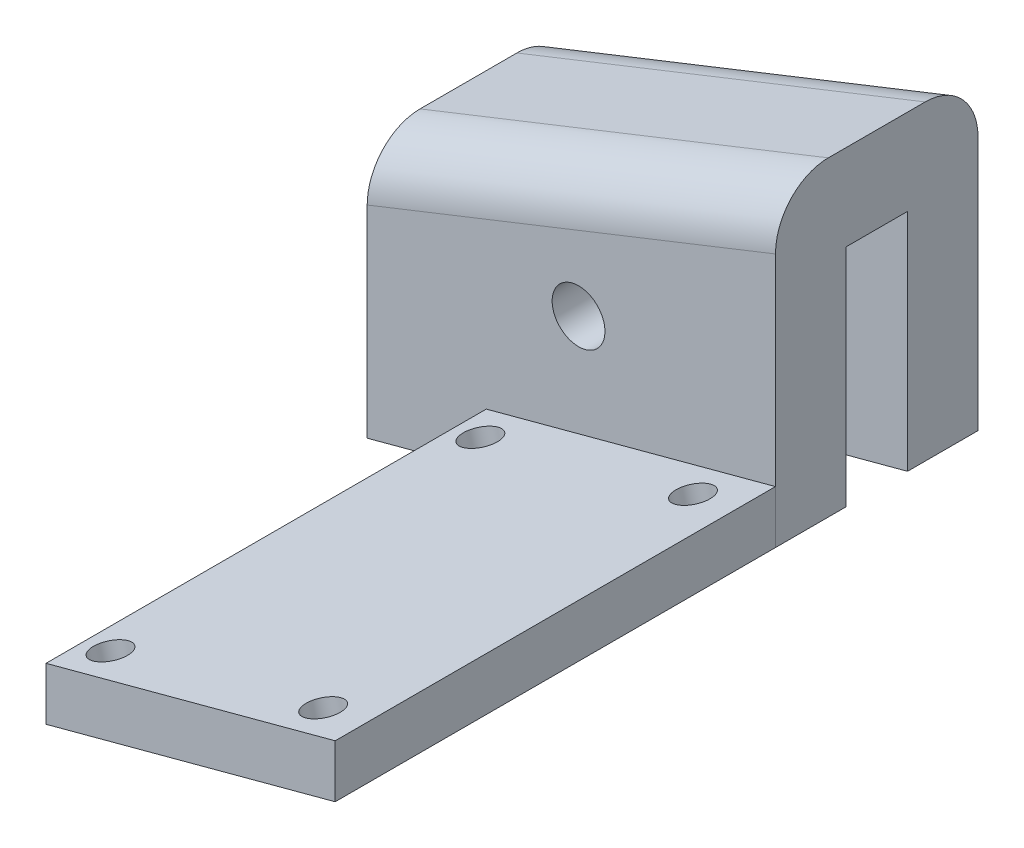
ISO-10303-21;
HEADER;
FILE_DESCRIPTION(('STEP AP214'),'2;1');
FILE_NAME('part.step','',(''),(''),'','','');
FILE_SCHEMA(('AUTOMOTIVE_DESIGN { 1 0 10303 214 1 1 1 1 }'));
ENDSEC;
DATA;
#1=APPLICATION_CONTEXT('core data for automotive mechanical design processes');
#2=APPLICATION_PROTOCOL_DEFINITION('international standard','automotive_design',2000,#1);
#3=PRODUCT_CONTEXT('',#1,'mechanical');
#4=PRODUCT('Part','Part','',(#3));
#5=PRODUCT_RELATED_PRODUCT_CATEGORY('part','',(#4));
#6=PRODUCT_DEFINITION_FORMATION('','',#4);
#7=PRODUCT_DEFINITION_CONTEXT('part definition',#1,'design');
#8=PRODUCT_DEFINITION('design','',#6,#7);
#9=PRODUCT_DEFINITION_SHAPE('','',#8);
#10=(LENGTH_UNIT() NAMED_UNIT(*) SI_UNIT(.MILLI.,.METRE.));
#11=(NAMED_UNIT(*) PLANE_ANGLE_UNIT() SI_UNIT($,.RADIAN.));
#12=(NAMED_UNIT(*) SI_UNIT($,.STERADIAN.) SOLID_ANGLE_UNIT());
#13=UNCERTAINTY_MEASURE_WITH_UNIT(LENGTH_MEASURE(1.E-05),#10,'distance_accuracy_value','');
#14=(GEOMETRIC_REPRESENTATION_CONTEXT(3) GLOBAL_UNCERTAINTY_ASSIGNED_CONTEXT((#13)) GLOBAL_UNIT_ASSIGNED_CONTEXT((#10,
#11,#12)) REPRESENTATION_CONTEXT('',''));
#15=CARTESIAN_POINT('',(0.,0.,0.));
#16=DIRECTION('',(0.,0.,1.));
#17=DIRECTION('',(1.,0.,0.));
#18=AXIS2_PLACEMENT_3D('',#15,#16,#17);
#19=CARTESIAN_POINT('',(0.,0.,4.));
#20=DIRECTION('',(0.,0.,1.));
#21=DIRECTION('',(1.,0.,0.));
#22=AXIS2_PLACEMENT_3D('',#19,#20,#21);
#23=PLANE('',#22);
#24=DIRECTION('',(0.965925826289065,0.258819045102531,0.));
#25=VECTOR('',#24,1.);
#26=CARTESIAN_POINT('',(180.956435006935,-56.1704509067187,4.));
#27=LINE('',#26,#25);
#28=CARTESIAN_POINT('',(180.956435006935,-56.1704509067187,4.));
#29=VERTEX_POINT('',#28);
#30=CARTESIAN_POINT('',(197.377174053849,-51.7705271399756,4.));
#31=VERTEX_POINT('',#30);
#32=EDGE_CURVE('E102',#29,#31,#27,.T.);
#33=ORIENTED_EDGE('',*,*,#32,.F.);
#34=DIRECTION('',(0.,-1.,0.));
#35=VECTOR('',#34,1.);
#36=CARTESIAN_POINT('',(180.956435006935,-53.1704509067186,4.));
#37=LINE('',#36,#35);
#38=CARTESIAN_POINT('',(180.956435006935,-53.1704509067186,4.));
#39=VERTEX_POINT('',#38);
#40=EDGE_CURVE('E117',#39,#29,#37,.T.);
#41=ORIENTED_EDGE('',*,*,#40,.F.);
#42=DIRECTION('',(-0.965925826289066,-0.258819045102531,0.));
#43=VECTOR('',#42,1.);
#44=CARTESIAN_POINT('',(197.377174053849,-48.7705271399756,4.));
#45=LINE('',#44,#43);
#46=CARTESIAN_POINT('',(197.377174053849,-48.7705271399756,4.));
#47=VERTEX_POINT('',#46);
#48=EDGE_CURVE('E104',#47,#39,#45,.T.);
#49=ORIENTED_EDGE('',*,*,#48,.F.);
#50=DIRECTION('',(0.,1.,0.));
#51=VECTOR('',#50,1.);
#52=CARTESIAN_POINT('',(197.377174053849,-51.7705271399756,4.));
#53=LINE('',#52,#51);
#54=EDGE_CURVE('E94',#31,#47,#53,.T.);
#55=ORIENTED_EDGE('',*,*,#54,.F.);
#56=EDGE_LOOP('',(#33,#41,#49,#55));
#57=FACE_BOUND('',#56,.T.);
#58=ADVANCED_FACE('F52',(#57),#23,.F.);
#59=CARTESIAN_POINT('',(180.956435006935,-53.1704509067186,47.0110949861595));
#60=DIRECTION('',(1.,0.,0.));
#61=DIRECTION('',(0.,0.,-1.));
#62=AXIS2_PLACEMENT_3D('',#59,#60,#61);
#63=PLANE('',#62);
#64=DIRECTION('',(0.,0.,-1.));
#65=VECTOR('',#64,1.);
#66=CARTESIAN_POINT('',(180.956435006935,-56.1704509067187,47.0110949861595));
#67=LINE('',#66,#65);
#68=CARTESIAN_POINT('',(180.956435006935,-56.1704509067187,29.));
#69=VERTEX_POINT('',#68);
#70=EDGE_CURVE('E107',#69,#29,#67,.T.);
#71=ORIENTED_EDGE('',*,*,#70,.F.);
#72=DIRECTION('',(0.,1.,0.));
#73=VECTOR('',#72,1.);
#74=CARTESIAN_POINT('',(180.956435006935,-53.1704509067186,29.));
#75=LINE('',#74,#73);
#76=CARTESIAN_POINT('',(180.956435006935,-53.1704509067186,29.));
#77=VERTEX_POINT('',#76);
#78=EDGE_CURVE('E56',#69,#77,#75,.T.);
#79=ORIENTED_EDGE('',*,*,#78,.T.);
#80=DIRECTION('',(0.,0.,-1.));
#81=VECTOR('',#80,1.);
#82=CARTESIAN_POINT('',(180.956435006935,-53.1704509067186,47.0110949861595));
#83=LINE('',#82,#81);
#84=EDGE_CURVE('E120',#77,#39,#83,.T.);
#85=ORIENTED_EDGE('',*,*,#84,.T.);
#86=ORIENTED_EDGE('',*,*,#40,.T.);
#87=EDGE_LOOP('',(#71,#79,#85,#86));
#88=FACE_BOUND('',#87,.T.);
#89=ADVANCED_FACE('F166',(#88),#63,.F.);
#90=CARTESIAN_POINT('',(197.377174053849,-48.7705271399756,47.0110949861595));
#91=DIRECTION('',(0.258819045102531,-0.965925826289066,0.));
#92=DIRECTION('',(0.965925826289066,0.258819045102531,0.));
#93=AXIS2_PLACEMENT_3D('',#90,#91,#92);
#94=PLANE('',#93);
#95=CARTESIAN_POINT('',(182.621249572658,-52.7243651882857,27.));
#96=DIRECTION('',(0.258819045102531,-0.965925826289066,0.));
#97=DIRECTION('',(0.965925826289066,0.258819045102531,0.));
#98=AXIS2_PLACEMENT_3D('',#95,#96,#97);
#99=CIRCLE('',#98,0.999999999999999);
#100=CARTESIAN_POINT('',(183.587175398947,-52.4655461431831,27.));
#101=VERTEX_POINT('',#100);
#102=EDGE_CURVE('E109',#101,#101,#99,.T.);
#103=ORIENTED_EDGE('',*,*,#102,.T.);
#104=EDGE_LOOP('',(#103));
#105=FACE_BOUND('',#104,.T.);
#106=CARTESIAN_POINT('',(194.695322401271,-49.489127124504,6.));
#107=DIRECTION('',(0.258819045102531,-0.965925826289066,0.));
#108=DIRECTION('',(0.965925826289066,0.258819045102531,0.));
#109=AXIS2_PLACEMENT_3D('',#106,#107,#108);
#110=CIRCLE('',#109,0.999999999999999);
#111=CARTESIAN_POINT('',(195.66124822756,-49.2303080794015,6.));
#112=VERTEX_POINT('',#111);
#113=EDGE_CURVE('E112',#112,#112,#110,.T.);
#114=ORIENTED_EDGE('',*,*,#113,.T.);
#115=EDGE_LOOP('',(#114));
#116=FACE_BOUND('',#115,.T.);
#117=CARTESIAN_POINT('',(194.695322401271,-49.489127124504,27.));
#118=DIRECTION('',(0.258819045102531,-0.965925826289066,0.));
#119=DIRECTION('',(0.965925826289066,0.258819045102531,0.));
#120=AXIS2_PLACEMENT_3D('',#117,#118,#119);
#121=CIRCLE('',#120,0.999999999999999);
#122=CARTESIAN_POINT('',(195.66124822756,-49.2303080794015,27.));
#123=VERTEX_POINT('',#122);
#124=EDGE_CURVE('E131',#123,#123,#121,.T.);
#125=ORIENTED_EDGE('',*,*,#124,.T.);
#126=EDGE_LOOP('',(#125));
#127=FACE_BOUND('',#126,.T.);
#128=CARTESIAN_POINT('',(182.621249572658,-52.7243651882857,6.));
#129=DIRECTION('',(0.258819045102531,-0.965925826289066,0.));
#130=DIRECTION('',(0.965925826289066,0.258819045102531,0.));
#131=AXIS2_PLACEMENT_3D('',#128,#129,#130);
#132=CIRCLE('',#131,0.999999999999999);
#133=CARTESIAN_POINT('',(183.587175398947,-52.4655461431832,6.));
#134=VERTEX_POINT('',#133);
#135=EDGE_CURVE('E134',#134,#134,#132,.T.);
#136=ORIENTED_EDGE('',*,*,#135,.T.);
#137=EDGE_LOOP('',(#136));
#138=FACE_BOUND('',#137,.T.);
#139=ORIENTED_EDGE('',*,*,#84,.F.);
#140=DIRECTION('',(0.965925826289066,0.258819045102531,0.));
#141=VECTOR('',#140,1.);
#142=CARTESIAN_POINT('',(197.377174053849,-48.7705271399756,29.));
#143=LINE('',#142,#141);
#144=CARTESIAN_POINT('',(197.377174053849,-48.7705271399756,29.));
#145=VERTEX_POINT('',#144);
#146=EDGE_CURVE('E126',#77,#145,#143,.T.);
#147=ORIENTED_EDGE('',*,*,#146,.T.);
#148=DIRECTION('',(0.,0.,-1.));
#149=VECTOR('',#148,1.);
#150=CARTESIAN_POINT('',(197.377174053849,-48.7705271399756,47.0110949861595));
#151=LINE('',#150,#149);
#152=EDGE_CURVE('E98',#145,#47,#151,.T.);
#153=ORIENTED_EDGE('',*,*,#152,.T.);
#154=ORIENTED_EDGE('',*,*,#48,.T.);
#155=EDGE_LOOP('',(#139,#147,#153,#154));
#156=FACE_BOUND('',#155,.T.);
#157=ADVANCED_FACE('F125',(#105,#116,#127,#138,#156),#94,.F.);
#158=CARTESIAN_POINT('',(197.377174053849,-51.7705271399756,47.0110949861595));
#159=DIRECTION('',(-1.,0.,0.));
#160=DIRECTION('',(0.,0.,1.));
#161=AXIS2_PLACEMENT_3D('',#158,#159,#160);
#162=PLANE('',#161);
#163=ORIENTED_EDGE('',*,*,#152,.F.);
#164=DIRECTION('',(0.,-1.,0.));
#165=VECTOR('',#164,1.);
#166=CARTESIAN_POINT('',(197.377174053849,-51.7705271399756,29.));
#167=LINE('',#166,#165);
#168=CARTESIAN_POINT('',(197.377174053849,-51.7705271399756,29.));
#169=VERTEX_POINT('',#168);
#170=EDGE_CURVE('E61',#145,#169,#167,.T.);
#171=ORIENTED_EDGE('',*,*,#170,.T.);
#172=DIRECTION('',(0.,0.,-1.));
#173=VECTOR('',#172,1.);
#174=CARTESIAN_POINT('',(197.377174053849,-51.7705271399756,47.0110949861595));
#175=LINE('',#174,#173);
#176=EDGE_CURVE('E91',#169,#31,#175,.T.);
#177=ORIENTED_EDGE('',*,*,#176,.T.);
#178=ORIENTED_EDGE('',*,*,#54,.T.);
#179=EDGE_LOOP('',(#163,#171,#177,#178));
#180=FACE_BOUND('',#179,.T.);
#181=ADVANCED_FACE('F93',(#180),#162,.F.);
#182=CARTESIAN_POINT('',(180.956435006935,-56.1704509067187,47.0110949861595));
#183=DIRECTION('',(-0.258819045102531,0.965925826289065,0.));
#184=DIRECTION('',(-0.965925826289066,-0.258819045102531,0.));
#185=AXIS2_PLACEMENT_3D('',#182,#183,#184);
#186=PLANE('',#185);
#187=CARTESIAN_POINT('',(183.371249572658,-55.5234032939624,27.));
#188=DIRECTION('',(0.258819045102531,-0.965925826289065,0.));
#189=DIRECTION('',(0.965925826289066,0.258819045102531,0.));
#190=AXIS2_PLACEMENT_3D('',#187,#188,#189);
#191=CIRCLE('',#190,0.999999999999999);
#192=CARTESIAN_POINT('',(184.337175398947,-55.2645842488598,27.));
#193=VERTEX_POINT('',#192);
#194=EDGE_CURVE('E140',#193,#193,#191,.T.);
#195=ORIENTED_EDGE('',*,*,#194,.F.);
#196=EDGE_LOOP('',(#195));
#197=FACE_BOUND('',#196,.T.);
#198=CARTESIAN_POINT('',(195.445322401271,-52.2881652301807,6.));
#199=DIRECTION('',(0.258819045102531,-0.965925826289065,0.));
#200=DIRECTION('',(0.965925826289066,0.258819045102531,0.));
#201=AXIS2_PLACEMENT_3D('',#198,#199,#200);
#202=CIRCLE('',#201,0.999999999999999);
#203=CARTESIAN_POINT('',(196.41124822756,-52.0293461850782,6.));
#204=VERTEX_POINT('',#203);
#205=EDGE_CURVE('E141',#204,#204,#202,.T.);
#206=ORIENTED_EDGE('',*,*,#205,.F.);
#207=EDGE_LOOP('',(#206));
#208=FACE_BOUND('',#207,.T.);
#209=CARTESIAN_POINT('',(195.445322401271,-52.2881652301807,27.));
#210=DIRECTION('',(0.258819045102531,-0.965925826289065,0.));
#211=DIRECTION('',(0.965925826289066,0.258819045102531,0.));
#212=AXIS2_PLACEMENT_3D('',#209,#210,#211);
#213=CIRCLE('',#212,0.999999999999999);
#214=CARTESIAN_POINT('',(196.41124822756,-52.0293461850782,27.));
#215=VERTEX_POINT('',#214);
#216=EDGE_CURVE('E144',#215,#215,#213,.T.);
#217=ORIENTED_EDGE('',*,*,#216,.F.);
#218=EDGE_LOOP('',(#217));
#219=FACE_BOUND('',#218,.T.);
#220=CARTESIAN_POINT('',(183.371249572658,-55.5234032939624,6.));
#221=DIRECTION('',(0.258819045102531,-0.965925826289065,0.));
#222=DIRECTION('',(0.965925826289066,0.258819045102531,0.));
#223=AXIS2_PLACEMENT_3D('',#220,#221,#222);
#224=CIRCLE('',#223,0.999999999999999);
#225=CARTESIAN_POINT('',(184.337175398947,-55.2645842488598,6.));
#226=VERTEX_POINT('',#225);
#227=EDGE_CURVE('E137',#226,#226,#224,.T.);
#228=ORIENTED_EDGE('',*,*,#227,.F.);
#229=EDGE_LOOP('',(#228));
#230=FACE_BOUND('',#229,.T.);
#231=ORIENTED_EDGE('',*,*,#176,.F.);
#232=DIRECTION('',(-0.965925826289066,-0.258819045102531,0.));
#233=VECTOR('',#232,1.);
#234=CARTESIAN_POINT('',(180.956435006935,-56.1704509067187,29.));
#235=LINE('',#234,#233);
#236=EDGE_CURVE('E12',#169,#69,#235,.T.);
#237=ORIENTED_EDGE('',*,*,#236,.T.);
#238=ORIENTED_EDGE('',*,*,#70,.T.);
#239=ORIENTED_EDGE('',*,*,#32,.T.);
#240=EDGE_LOOP('',(#231,#237,#238,#239));
#241=FACE_BOUND('',#240,.T.);
#242=ADVANCED_FACE('F54',(#197,#208,#219,#230,#241),#186,.F.);
#243=CARTESIAN_POINT('',(174.453773268014,-58.9481100487254,29.));
#244=DIRECTION('',(0.,0.,-1.));
#245=DIRECTION('',(0.965925826289065,0.258819045102531,0.));
#246=AXIS2_PLACEMENT_3D('',#243,#244,#245);
#247=PLANE('',#246);
#248=ORIENTED_EDGE('',*,*,#170,.F.);
#249=ORIENTED_EDGE('',*,*,#146,.F.);
#250=ORIENTED_EDGE('',*,*,#78,.F.);
#251=ORIENTED_EDGE('',*,*,#236,.F.);
#252=EDGE_LOOP('',(#248,#249,#250,#251));
#253=FACE_BOUND('',#252,.T.);
#254=ADVANCED_FACE('F155',(#253),#247,.F.);
#255=CARTESIAN_POINT('',(174.571402039172,-22.6819252001342,6.));
#256=DIRECTION('',(0.258819045102531,-0.965925826289066,0.));
#257=DIRECTION('',(0.965925826289066,0.258819045102531,0.));
#258=AXIS2_PLACEMENT_3D('',#255,#256,#257);
#259=CYLINDRICAL_SURFACE('',#258,0.999999999999999);
#260=ORIENTED_EDGE('',*,*,#227,.T.);
#261=EDGE_LOOP('',(#260));
#262=FACE_BOUND('',#261,.T.);
#263=ORIENTED_EDGE('',*,*,#135,.F.);
#264=EDGE_LOOP('',(#263));
#265=FACE_BOUND('',#264,.T.);
#266=ADVANCED_FACE('F159',(#262,#265),#259,.F.);
#267=CARTESIAN_POINT('',(186.645474867785,-19.4466871363525,27.));
#268=DIRECTION('',(0.258819045102531,-0.965925826289066,0.));
#269=DIRECTION('',(0.965925826289066,0.258819045102531,0.));
#270=AXIS2_PLACEMENT_3D('',#267,#268,#269);
#271=CYLINDRICAL_SURFACE('',#270,0.999999999999999);
#272=ORIENTED_EDGE('',*,*,#216,.T.);
#273=EDGE_LOOP('',(#272));
#274=FACE_BOUND('',#273,.T.);
#275=ORIENTED_EDGE('',*,*,#124,.F.);
#276=EDGE_LOOP('',(#275));
#277=FACE_BOUND('',#276,.T.);
#278=ADVANCED_FACE('F150',(#274,#277),#271,.F.);
#279=CARTESIAN_POINT('',(186.645474867785,-19.4466871363525,6.));
#280=DIRECTION('',(0.258819045102531,-0.965925826289066,0.));
#281=DIRECTION('',(0.965925826289066,0.258819045102531,0.));
#282=AXIS2_PLACEMENT_3D('',#279,#280,#281);
#283=CYLINDRICAL_SURFACE('',#282,0.999999999999999);
#284=ORIENTED_EDGE('',*,*,#205,.T.);
#285=EDGE_LOOP('',(#284));
#286=FACE_BOUND('',#285,.T.);
#287=ORIENTED_EDGE('',*,*,#113,.F.);
#288=EDGE_LOOP('',(#287));
#289=FACE_BOUND('',#288,.T.);
#290=ADVANCED_FACE('F183',(#286,#289),#283,.F.);
#291=CARTESIAN_POINT('',(174.571402039172,-22.6819252001341,27.));
#292=DIRECTION('',(0.258819045102531,-0.965925826289066,0.));
#293=DIRECTION('',(0.965925826289066,0.258819045102531,0.));
#294=AXIS2_PLACEMENT_3D('',#291,#292,#293);
#295=CYLINDRICAL_SURFACE('',#294,0.999999999999999);
#296=ORIENTED_EDGE('',*,*,#194,.T.);
#297=EDGE_LOOP('',(#296));
#298=FACE_BOUND('',#297,.T.);
#299=ORIENTED_EDGE('',*,*,#102,.F.);
#300=EDGE_LOOP('',(#299));
#301=FACE_BOUND('',#300,.T.);
#302=ADVANCED_FACE('F186',(#298,#301),#295,.F.);
#303=CLOSED_SHELL('',(#58,#89,#157,#181,#242,#254,#266,#278,#290,#302));
#304=MANIFOLD_SOLID_BREP('B2',#303);
#305=CARTESIAN_POINT('',(0.,0.,0.));
#306=DIRECTION('',(0.,0.,-1.));
#307=DIRECTION('',(-1.,0.,0.));
#308=AXIS2_PLACEMENT_3D('',#305,#306,#307);
#309=PLANE('',#308);
#310=CARTESIAN_POINT('',(186.194954222912,-45.9821842224364,0.));
#311=DIRECTION('',(0.,0.,-1.));
#312=DIRECTION('',(-1.,0.,0.));
#313=AXIS2_PLACEMENT_3D('',#310,#311,#312);
#314=CIRCLE('',#313,1.5);
#315=CARTESIAN_POINT('',(184.694954222912,-45.9821842224364,0.));
#316=VERTEX_POINT('',#315);
#317=EDGE_CURVE('E484',#316,#316,#314,.T.);
#318=ORIENTED_EDGE('',*,*,#317,.F.);
#319=EDGE_LOOP('',(#318));
#320=FACE_BOUND('',#319,.T.);
#321=DIRECTION('',(0.,-1.,0.));
#322=VECTOR('',#321,1.);
#323=CARTESIAN_POINT('',(174.194954222912,-57.9821842224364,0.));
#324=LINE('',#323,#322);
#325=CARTESIAN_POINT('',(174.194954222913,-48.3475542224693,0.));
#326=VERTEX_POINT('',#325);
#327=CARTESIAN_POINT('',(174.194954222912,-57.9821842224364,0.));
#328=VERTEX_POINT('',#327);
#329=EDGE_CURVE('E459',#326,#328,#324,.T.);
#330=ORIENTED_EDGE('',*,*,#329,.F.);
#331=CARTESIAN_POINT('',(154.999999916871,-54.0482308469535,0.));
#332=CARTESIAN_POINT('',(155.731406057589,-53.8620106613131,0.));
#333=CARTESIAN_POINT('',(158.353021704778,-53.1825677741812,0.));
#334=CARTESIAN_POINT('',(164.660096697761,-51.4419935318653,0.));
#335=CARTESIAN_POINT('',(173.748419645787,-48.5940055598413,0.));
#336=CARTESIAN_POINT('',(184.26927531825,-44.7413254498893,0.));
#337=CARTESIAN_POINT('',(197.799833821469,-39.0240238482658,0.));
#338=CARTESIAN_POINT('',(213.78961101986,-30.7928618903945,0.));
#339=CARTESIAN_POINT('',(231.549414252278,-19.1756565135875,0.));
#340=CARTESIAN_POINT('',(247.929177810818,-5.79714362559889,0.));
#341=CARTESIAN_POINT('',(260.462024810725,6.84921209286295,0.));
#342=CARTESIAN_POINT('',(269.83072194683,17.8876076715245,0.));
#343=CARTESIAN_POINT('',(276.528937944344,26.6313311327526,0.));
#344=CARTESIAN_POINT('',(281.840598342277,34.3146395086273,0.));
#345=CARTESIAN_POINT('',(285.585821403611,40.1670188130852,0.));
#346=CARTESIAN_POINT('',(287.25914441583,42.8980000515154,0.));
#347=CARTESIAN_POINT('',(287.922750115386,44.0000001015957,0.));
#348=B_SPLINE_CURVE_WITH_KNOTS('',3,(#331,#332,#333,#334,#335,#336,#337,#338,#339,#340,#341,
#342,#343,#344,#345,#346,#347),.UNSPECIFIED.,.F.,.F.,(4,1,1,1,1,1,1,1,1,1,1,1,1,1,4),
(0.497752743346389,0.497805621376866,0.497942734042408,0.49821695937349,0.498491184704572,
0.498765410035654,0.499313860697819,0.499862311359984,0.500410762022148,0.500959212684313,
0.501233438015395,0.501507663346477,0.50178188867756,0.501919001343101,0.502011046799067),.UNSPECIFIED.);
#349=CARTESIAN_POINT('',(197.377174053848,-38.9869215014192,0.));
#350=VERTEX_POINT('',#349);
#351=EDGE_CURVE('E369',#326,#350,#348,.T.);
#352=ORIENTED_EDGE('',*,*,#351,.T.);
#353=DIRECTION('',(0.,1.,0.));
#354=VECTOR('',#353,1.);
#355=CARTESIAN_POINT('',(197.377174053848,-34.1054023962247,0.));
#356=LINE('',#355,#354);
#357=CARTESIAN_POINT('',(197.377174053849,-51.7705271399756,0.));
#358=VERTEX_POINT('',#357);
#359=EDGE_CURVE('E452',#358,#350,#356,.T.);
#360=ORIENTED_EDGE('',*,*,#359,.F.);
#361=DIRECTION('',(0.965925826289065,0.258819045102531,0.));
#362=VECTOR('',#361,1.);
#363=CARTESIAN_POINT('',(174.194954222912,-57.9821842224364,0.));
#364=LINE('',#363,#362);
#365=EDGE_CURVE('E456',#328,#358,#364,.T.);
#366=ORIENTED_EDGE('',*,*,#365,.F.);
#367=EDGE_LOOP('',(#330,#352,#360,#366));
#368=FACE_BOUND('',#367,.T.);
#369=ADVANCED_FACE('F265',(#320,#368),#309,.T.);
#370=CARTESIAN_POINT('',(174.194954222913,-43.2884389489036,4.));
#371=DIRECTION('',(0.368282170769965,-0.92971406501836,0.));
#372=DIRECTION('',(0.92971406501836,0.368282170769965,0.));
#373=AXIS2_PLACEMENT_3D('',#370,#371,#372);
#374=PLANE('',#373);
#375=DIRECTION('',(0.,0.,-1.));
#376=VECTOR('',#375,1.);
#377=CARTESIAN_POINT('',(197.377174053848,-34.1054023962247,4.));
#378=LINE('',#377,#376);
#379=CARTESIAN_POINT('',(197.377174053848,-34.1054023962247,1.));
#380=VERTEX_POINT('',#379);
#381=CARTESIAN_POINT('',(197.377174053848,-34.1054023962247,-4.5));
#382=VERTEX_POINT('',#381);
#383=EDGE_CURVE('E449',#380,#382,#378,.T.);
#384=ORIENTED_EDGE('',*,*,#383,.T.);
#385=DIRECTION('',(0.92971406501836,0.368282170769965,0.));
#386=VECTOR('',#385,1.);
#387=CARTESIAN_POINT('',(174.194954222913,-43.2884389489036,-4.5));
#388=LINE('',#387,#386);
#389=CARTESIAN_POINT('',(174.194954222913,-43.2884389489036,-4.5));
#390=VERTEX_POINT('',#389);
#391=EDGE_CURVE('E287',#382,#390,#388,.F.);
#392=ORIENTED_EDGE('',*,*,#391,.T.);
#393=DIRECTION('',(0.,0.,-1.));
#394=VECTOR('',#393,1.);
#395=CARTESIAN_POINT('',(174.194954222913,-43.2884389489036,4.));
#396=LINE('',#395,#394);
#397=CARTESIAN_POINT('',(174.194954222913,-43.2884389489036,1.));
#398=VERTEX_POINT('',#397);
#399=EDGE_CURVE('E436',#398,#390,#396,.T.);
#400=ORIENTED_EDGE('',*,*,#399,.F.);
#401=DIRECTION('',(-0.92971406501836,-0.368282170769965,0.));
#402=VECTOR('',#401,1.);
#403=CARTESIAN_POINT('',(174.194954222913,-43.2884389489036,1.));
#404=LINE('',#403,#402);
#405=EDGE_CURVE('E429',#398,#380,#404,.F.);
#406=ORIENTED_EDGE('',*,*,#405,.T.);
#407=EDGE_LOOP('',(#384,#392,#400,#406));
#408=FACE_BOUND('',#407,.T.);
#409=ADVANCED_FACE('F401',(#408),#374,.F.);
#410=CARTESIAN_POINT('',(174.194954222912,-57.9821842224364,4.));
#411=DIRECTION('',(1.,0.,0.));
#412=DIRECTION('',(0.,1.,0.));
#413=AXIS2_PLACEMENT_3D('',#410,#411,#412);
#414=PLANE('',#413);
#415=ORIENTED_EDGE('',*,*,#399,.T.);
#416=CARTESIAN_POINT('',(174.194954222913,-46.5152375022209,-4.5));
#417=DIRECTION('',(1.,0.,0.));
#418=DIRECTION('',(0.,-1.,0.));
#419=AXIS2_PLACEMENT_3D('',#416,#417,#418);
#420=ELLIPSE('',#419,3.2267985533174,3.);
#421=CARTESIAN_POINT('',(174.194954222912,-46.515237502221,-7.5));
#422=VERTEX_POINT('',#421);
#423=EDGE_CURVE('E273',#390,#422,#420,.F.);
#424=ORIENTED_EDGE('',*,*,#423,.T.);
#425=DIRECTION('',(0.,1.,0.));
#426=VECTOR('',#425,1.);
#427=CARTESIAN_POINT('',(174.194954222912,-57.9821842224364,-7.5));
#428=LINE('',#427,#426);
#429=CARTESIAN_POINT('',(174.194954222912,-57.9821842224364,-7.5));
#430=VERTEX_POINT('',#429);
#431=EDGE_CURVE('E363',#430,#422,#428,.T.);
#432=ORIENTED_EDGE('',*,*,#431,.F.);
#433=DIRECTION('',(0.,0.,1.));
#434=VECTOR('',#433,1.);
#435=CARTESIAN_POINT('',(174.194954222912,-57.9821842224364,-7.5));
#436=LINE('',#435,#434);
#437=CARTESIAN_POINT('',(174.194954222912,-57.9821842224364,-3.5));
#438=VERTEX_POINT('',#437);
#439=EDGE_CURVE('E361',#430,#438,#436,.T.);
#440=ORIENTED_EDGE('',*,*,#439,.T.);
#441=DIRECTION('',(0.,1.,0.));
#442=VECTOR('',#441,1.);
#443=CARTESIAN_POINT('',(174.194954222912,-57.9821842224364,-3.5));
#444=LINE('',#443,#442);
#445=CARTESIAN_POINT('',(174.194954222912,-48.3475542224685,-3.5));
#446=VERTEX_POINT('',#445);
#447=EDGE_CURVE('E354',#438,#446,#444,.T.);
#448=ORIENTED_EDGE('',*,*,#447,.T.);
#449=DIRECTION('',(0.,0.,1.));
#450=VECTOR('',#449,1.);
#451=CARTESIAN_POINT('',(174.194954222913,-48.3475542224693,-3.5));
#452=LINE('',#451,#450);
#453=EDGE_CURVE('E461',#446,#326,#452,.T.);
#454=ORIENTED_EDGE('',*,*,#453,.T.);
#455=ORIENTED_EDGE('',*,*,#329,.T.);
#456=DIRECTION('',(0.,0.,-1.));
#457=VECTOR('',#456,1.);
#458=CARTESIAN_POINT('',(174.194954222912,-57.9821842224364,4.));
#459=LINE('',#458,#457);
#460=CARTESIAN_POINT('',(174.194954222912,-57.9821842224364,4.));
#461=VERTEX_POINT('',#460);
#462=EDGE_CURVE('E443',#461,#328,#459,.T.);
#463=ORIENTED_EDGE('',*,*,#462,.F.);
#464=DIRECTION('',(0.,-1.,0.));
#465=VECTOR('',#464,1.);
#466=CARTESIAN_POINT('',(174.194954222913,-48.3475542224685,4.));
#467=LINE('',#466,#465);
#468=CARTESIAN_POINT('',(174.194954222913,-46.5152375022209,4.));
#469=VERTEX_POINT('',#468);
#470=EDGE_CURVE('E455',#469,#461,#467,.T.);
#471=ORIENTED_EDGE('',*,*,#470,.F.);
#472=CARTESIAN_POINT('',(174.194954222913,-46.5152375022209,1.));
#473=DIRECTION('',(1.,0.,0.));
#474=DIRECTION('',(0.,-1.,0.));
#475=AXIS2_PLACEMENT_3D('',#472,#473,#474);
#476=ELLIPSE('',#475,3.2267985533174,3.);
#477=EDGE_CURVE('E280',#469,#398,#476,.F.);
#478=ORIENTED_EDGE('',*,*,#477,.T.);
#479=EDGE_LOOP('',(#415,#424,#432,#440,#448,#454,#455,#463,#471,#478));
#480=FACE_BOUND('',#479,.T.);
#481=ADVANCED_FACE('F408',(#480),#414,.F.);
#482=CARTESIAN_POINT('',(174.194954222912,-57.9821842224364,4.));
#483=DIRECTION('',(-0.258819045102531,0.965925826289065,0.));
#484=DIRECTION('',(-0.965925826289066,-0.258819045102531,0.));
#485=AXIS2_PLACEMENT_3D('',#482,#483,#484);
#486=PLANE('',#485);
#487=ORIENTED_EDGE('',*,*,#365,.T.);
#488=DIRECTION('',(0.,0.,-1.));
#489=VECTOR('',#488,1.);
#490=CARTESIAN_POINT('',(197.377174053849,-51.7705271399756,4.));
#491=LINE('',#490,#489);
#492=CARTESIAN_POINT('',(197.377174053849,-51.7705271399756,4.));
#493=VERTEX_POINT('',#492);
#494=EDGE_CURVE('E446',#493,#358,#491,.T.);
#495=ORIENTED_EDGE('',*,*,#494,.F.);
#496=DIRECTION('',(0.965925826289065,0.258819045102531,0.));
#497=VECTOR('',#496,1.);
#498=CARTESIAN_POINT('',(174.194954222912,-57.9821842224364,4.));
#499=LINE('',#498,#497);
#500=EDGE_CURVE('E464',#461,#493,#499,.T.);
#501=ORIENTED_EDGE('',*,*,#500,.F.);
#502=ORIENTED_EDGE('',*,*,#462,.T.);
#503=EDGE_LOOP('',(#487,#495,#501,#502));
#504=FACE_BOUND('',#503,.T.);
#505=ADVANCED_FACE('F405',(#504),#486,.F.);
#506=CARTESIAN_POINT('',(197.377174053848,-34.1054023962247,4.));
#507=DIRECTION('',(-1.,0.,0.));
#508=DIRECTION('',(0.,0.,1.));
#509=AXIS2_PLACEMENT_3D('',#506,#507,#508);
#510=PLANE('',#509);
#511=DIRECTION('',(0.,-1.,0.));
#512=VECTOR('',#511,1.);
#513=CARTESIAN_POINT('',(197.377174053848,-34.1054023962247,-7.5));
#514=LINE('',#513,#512);
#515=CARTESIAN_POINT('',(197.377174053848,-37.3322009495418,-7.5));
#516=VERTEX_POINT('',#515);
#517=CARTESIAN_POINT('',(197.377174053849,-51.7705271399756,-7.5));
#518=VERTEX_POINT('',#517);
#519=EDGE_CURVE('E344',#516,#518,#514,.T.);
#520=ORIENTED_EDGE('',*,*,#519,.F.);
#521=CARTESIAN_POINT('',(197.377174053848,-37.332200949542,-4.5));
#522=DIRECTION('',(-1.,0.,0.));
#523=DIRECTION('',(0.,-1.,0.));
#524=AXIS2_PLACEMENT_3D('',#521,#522,#523);
#525=ELLIPSE('',#524,3.22679855331731,3.);
#526=EDGE_CURVE('E431',#516,#382,#525,.F.);
#527=ORIENTED_EDGE('',*,*,#526,.T.);
#528=ORIENTED_EDGE('',*,*,#383,.F.);
#529=CARTESIAN_POINT('',(197.377174053848,-37.332200949542,1.));
#530=DIRECTION('',(-1.,0.,0.));
#531=DIRECTION('',(0.,-1.,0.));
#532=AXIS2_PLACEMENT_3D('',#529,#530,#531);
#533=ELLIPSE('',#532,3.22679855331731,3.);
#534=CARTESIAN_POINT('',(197.377174053847,-37.3322009495421,4.));
#535=VERTEX_POINT('',#534);
#536=EDGE_CURVE('E433',#380,#535,#533,.F.);
#537=ORIENTED_EDGE('',*,*,#536,.T.);
#538=DIRECTION('',(-1.346134836152E-13,1.,0.));
#539=VECTOR('',#538,1.);
#540=CARTESIAN_POINT('',(197.377174053849,-51.7705271399756,4.));
#541=LINE('',#540,#539);
#542=EDGE_CURVE('E451',#493,#535,#541,.T.);
#543=ORIENTED_EDGE('',*,*,#542,.F.);
#544=ORIENTED_EDGE('',*,*,#494,.T.);
#545=ORIENTED_EDGE('',*,*,#359,.T.);
#546=DIRECTION('',(0.,0.,1.));
#547=VECTOR('',#546,1.);
#548=CARTESIAN_POINT('',(197.377174053848,-38.9869215014173,-3.5));
#549=LINE('',#548,#547);
#550=CARTESIAN_POINT('',(197.377174053848,-38.9869215014173,-3.5));
#551=VERTEX_POINT('',#550);
#552=EDGE_CURVE('E381',#551,#350,#549,.T.);
#553=ORIENTED_EDGE('',*,*,#552,.F.);
#554=DIRECTION('',(0.,-1.,0.));
#555=VECTOR('',#554,1.);
#556=CARTESIAN_POINT('',(197.377174053848,-34.1054023962247,-3.5));
#557=LINE('',#556,#555);
#558=CARTESIAN_POINT('',(197.377174053849,-51.7705271399756,-3.5));
#559=VERTEX_POINT('',#558);
#560=EDGE_CURVE('E367',#551,#559,#557,.T.);
#561=ORIENTED_EDGE('',*,*,#560,.T.);
#562=DIRECTION('',(0.,0.,1.));
#563=VECTOR('',#562,1.);
#564=CARTESIAN_POINT('',(197.377174053849,-51.7705271399756,-7.5));
#565=LINE('',#564,#563);
#566=EDGE_CURVE('E359',#518,#559,#565,.T.);
#567=ORIENTED_EDGE('',*,*,#566,.F.);
#568=EDGE_LOOP('',(#520,#527,#528,#537,#543,#544,#545,#553,#561,#567));
#569=FACE_BOUND('',#568,.T.);
#570=ADVANCED_FACE('F365',(#569),#510,.F.);
#571=CARTESIAN_POINT('',(0.,0.,4.));
#572=DIRECTION('',(0.,0.,-1.));
#573=DIRECTION('',(-1.,0.,0.));
#574=AXIS2_PLACEMENT_3D('',#571,#572,#573);
#575=PLANE('',#574);
#576=CARTESIAN_POINT('',(186.194954222912,-45.9821842224364,4.));
#577=DIRECTION('',(0.,0.,-1.));
#578=DIRECTION('',(-1.,0.,0.));
#579=AXIS2_PLACEMENT_3D('',#576,#577,#578);
#580=CIRCLE('',#579,1.5);
#581=CARTESIAN_POINT('',(184.694954222912,-45.9821842224364,4.));
#582=VERTEX_POINT('',#581);
#583=EDGE_CURVE('E440',#582,#582,#580,.T.);
#584=ORIENTED_EDGE('',*,*,#583,.T.);
#585=EDGE_LOOP('',(#584));
#586=FACE_BOUND('',#585,.T.);
#587=ORIENTED_EDGE('',*,*,#542,.T.);
#588=DIRECTION('',(-0.92971406501836,-0.368282170769965,0.));
#589=VECTOR('',#588,1.);
#590=CARTESIAN_POINT('',(39.5530508358638,-99.850143708037,4.));
#591=LINE('',#590,#589);
#592=EDGE_CURVE('E50',#535,#469,#591,.T.);
#593=ORIENTED_EDGE('',*,*,#592,.T.);
#594=ORIENTED_EDGE('',*,*,#470,.T.);
#595=ORIENTED_EDGE('',*,*,#500,.T.);
#596=EDGE_LOOP('',(#587,#593,#594,#595));
#597=FACE_BOUND('',#596,.T.);
#598=ADVANCED_FACE('F393',(#586,#597),#575,.F.);
#599=CARTESIAN_POINT('',(154.999999916871,-54.0482308469535,-3.5));
#600=CARTESIAN_POINT('',(155.731406057589,-53.8620106613131,-3.5));
#601=CARTESIAN_POINT('',(158.353021704778,-53.1825677741812,-3.5));
#602=CARTESIAN_POINT('',(164.660096697761,-51.4419935318653,-3.5));
#603=CARTESIAN_POINT('',(173.748419645787,-48.5940055598413,-3.5));
#604=CARTESIAN_POINT('',(184.26927531825,-44.7413254498893,-3.5));
#605=CARTESIAN_POINT('',(197.799833821469,-39.0240238482658,-3.5));
#606=CARTESIAN_POINT('',(213.78961101986,-30.7928618903945,-3.5));
#607=CARTESIAN_POINT('',(231.549414252278,-19.1756565135875,-3.5));
#608=CARTESIAN_POINT('',(247.929177810818,-5.79714362559889,-3.5));
#609=CARTESIAN_POINT('',(260.462024810725,6.84921209286295,-3.5));
#610=CARTESIAN_POINT('',(269.83072194683,17.8876076715245,-3.5));
#611=CARTESIAN_POINT('',(276.528937944344,26.6313311327526,-3.5));
#612=CARTESIAN_POINT('',(281.840598342277,34.3146395086273,-3.5));
#613=CARTESIAN_POINT('',(285.585821403611,40.1670188130852,-3.5));
#614=CARTESIAN_POINT('',(287.25914441583,42.8980000515154,-3.5));
#615=CARTESIAN_POINT('',(287.922750115386,44.0000001015957,-3.5));
#616=B_SPLINE_CURVE_WITH_KNOTS('',3,(#599,#600,#601,#602,#603,#604,#605,#606,#607,#608,#609,
#610,#611,#612,#613,#614,#615),.UNSPECIFIED.,.F.,.F.,(4,1,1,1,1,1,1,1,1,1,1,1,1,1,4),
(0.497752743346389,0.497805621376866,0.497942734042408,0.49821695937349,0.498491184704572,
0.498765410035654,0.499313860697819,0.499862311359984,0.500410762022148,0.500959212684313,
0.501233438015395,0.501507663346477,0.50178188867756,0.501919001343101,0.502011046799067),.UNSPECIFIED.);
#617=DIRECTION('',(0.,0.,1.));
#618=VECTOR('',#617,1.);
#619=SURFACE_OF_LINEAR_EXTRUSION('',#616,#618);
#620=ORIENTED_EDGE('',*,*,#351,.F.);
#621=ORIENTED_EDGE('',*,*,#453,.F.);
#622=EDGE_CURVE('E372',#446,#551,#616,.T.);
#623=ORIENTED_EDGE('',*,*,#622,.T.);
#624=ORIENTED_EDGE('',*,*,#552,.T.);
#625=EDGE_LOOP('',(#620,#621,#623,#624));
#626=FACE_BOUND('',#625,.T.);
#627=ADVANCED_FACE('F389',(#626),#619,.T.);
#628=CARTESIAN_POINT('',(197.377174053849,-51.7705271399756,-7.5));
#629=DIRECTION('',(-0.258819045102531,0.965925826289065,0.));
#630=DIRECTION('',(-0.965925826289066,-0.258819045102531,0.));
#631=AXIS2_PLACEMENT_3D('',#628,#629,#630);
#632=PLANE('',#631);
#633=DIRECTION('',(-0.965925826289065,-0.258819045102531,0.));
#634=VECTOR('',#633,1.);
#635=CARTESIAN_POINT('',(197.377174053849,-51.7705271399756,-3.5));
#636=LINE('',#635,#634);
#637=EDGE_CURVE('E480',#559,#438,#636,.T.);
#638=ORIENTED_EDGE('',*,*,#637,.T.);
#639=ORIENTED_EDGE('',*,*,#439,.F.);
#640=DIRECTION('',(-0.965925826289065,-0.258819045102531,0.));
#641=VECTOR('',#640,1.);
#642=CARTESIAN_POINT('',(197.377174053849,-51.7705271399756,-7.5));
#643=LINE('',#642,#641);
#644=EDGE_CURVE('E348',#518,#430,#643,.T.);
#645=ORIENTED_EDGE('',*,*,#644,.F.);
#646=ORIENTED_EDGE('',*,*,#566,.T.);
#647=EDGE_LOOP('',(#638,#639,#645,#646));
#648=FACE_BOUND('',#647,.T.);
#649=ADVANCED_FACE('F358',(#648),#632,.F.);
#650=CARTESIAN_POINT('',(0.,0.,-7.5));
#651=DIRECTION('',(0.,0.,-1.));
#652=DIRECTION('',(-1.,0.,0.));
#653=AXIS2_PLACEMENT_3D('',#650,#651,#652);
#654=PLANE('',#653);
#655=CARTESIAN_POINT('',(186.194954222912,-45.9821842224364,-7.5));
#656=DIRECTION('',(0.,0.,-1.));
#657=DIRECTION('',(-1.,0.,0.));
#658=AXIS2_PLACEMENT_3D('',#655,#656,#657);
#659=CIRCLE('',#658,1.5);
#660=CARTESIAN_POINT('',(184.694954222912,-45.9821842224364,-7.5));
#661=VERTEX_POINT('',#660);
#662=EDGE_CURVE('E441',#661,#661,#659,.T.);
#663=ORIENTED_EDGE('',*,*,#662,.F.);
#664=EDGE_LOOP('',(#663));
#665=FACE_BOUND('',#664,.T.);
#666=ORIENTED_EDGE('',*,*,#431,.T.);
#667=DIRECTION('',(0.92971406501836,0.368282170769965,0.));
#668=VECTOR('',#667,1.);
#669=CARTESIAN_POINT('',(198.482020566158,-36.8945445912797,-7.5));
#670=LINE('',#669,#668);
#671=EDGE_CURVE('E351',#422,#516,#670,.T.);
#672=ORIENTED_EDGE('',*,*,#671,.T.);
#673=ORIENTED_EDGE('',*,*,#519,.T.);
#674=ORIENTED_EDGE('',*,*,#644,.T.);
#675=EDGE_LOOP('',(#666,#672,#673,#674));
#676=FACE_BOUND('',#675,.T.);
#677=ADVANCED_FACE('F347',(#665,#676),#654,.T.);
#678=CARTESIAN_POINT('',(0.,0.,-3.5));
#679=DIRECTION('',(0.,0.,-1.));
#680=DIRECTION('',(-1.,0.,0.));
#681=AXIS2_PLACEMENT_3D('',#678,#679,#680);
#682=PLANE('',#681);
#683=CARTESIAN_POINT('',(186.194954222912,-45.9821842224364,-3.5));
#684=DIRECTION('',(0.,0.,-1.));
#685=DIRECTION('',(-1.,0.,0.));
#686=AXIS2_PLACEMENT_3D('',#683,#684,#685);
#687=CIRCLE('',#686,1.5);
#688=CARTESIAN_POINT('',(184.694954222912,-45.9821842224364,-3.5));
#689=VERTEX_POINT('',#688);
#690=EDGE_CURVE('E437',#689,#689,#687,.T.);
#691=ORIENTED_EDGE('',*,*,#690,.T.);
#692=EDGE_LOOP('',(#691));
#693=FACE_BOUND('',#692,.T.);
#694=ORIENTED_EDGE('',*,*,#622,.F.);
#695=ORIENTED_EDGE('',*,*,#447,.F.);
#696=ORIENTED_EDGE('',*,*,#637,.F.);
#697=ORIENTED_EDGE('',*,*,#560,.F.);
#698=EDGE_LOOP('',(#694,#695,#696,#697));
#699=FACE_BOUND('',#698,.T.);
#700=ADVANCED_FACE('F496',(#693,#699),#682,.F.);
#701=CARTESIAN_POINT('',(186.194954222912,-45.9821842224364,26.5));
#702=DIRECTION('',(0.,0.,-1.));
#703=DIRECTION('',(-1.,0.,0.));
#704=AXIS2_PLACEMENT_3D('',#701,#702,#703);
#705=CYLINDRICAL_SURFACE('',#704,1.5);
#706=ORIENTED_EDGE('',*,*,#662,.T.);
#707=EDGE_LOOP('',(#706));
#708=FACE_BOUND('',#707,.T.);
#709=ORIENTED_EDGE('',*,*,#690,.F.);
#710=EDGE_LOOP('',(#709));
#711=FACE_BOUND('',#710,.T.);
#712=ADVANCED_FACE('F422',(#708,#711),#705,.F.);
#713=ORIENTED_EDGE('',*,*,#317,.T.);
#714=EDGE_LOOP('',(#713));
#715=FACE_BOUND('',#714,.T.);
#716=ORIENTED_EDGE('',*,*,#583,.F.);
#717=EDGE_LOOP('',(#716));
#718=FACE_BOUND('',#717,.T.);
#719=ADVANCED_FACE('F416',(#715,#718),#705,.F.);
#720=CARTESIAN_POINT('',(39.5530508358638,-99.850143708037,-4.5));
#721=DIRECTION('',(-0.92971406501836,-0.368282170769965,0.));
#722=DIRECTION('',(0.368282170769965,-0.92971406501836,0.));
#723=AXIS2_PLACEMENT_3D('',#720,#721,#722);
#724=CYLINDRICAL_SURFACE('',#723,3.);
#725=ORIENTED_EDGE('',*,*,#423,.F.);
#726=ORIENTED_EDGE('',*,*,#391,.F.);
#727=ORIENTED_EDGE('',*,*,#526,.F.);
#728=ORIENTED_EDGE('',*,*,#671,.F.);
#729=EDGE_LOOP('',(#725,#726,#727,#728));
#730=FACE_BOUND('',#729,.T.);
#731=ADVANCED_FACE('F414',(#730),#724,.T.);
#732=CARTESIAN_POINT('',(39.5530508358638,-99.850143708037,1.));
#733=DIRECTION('',(-0.92971406501836,-0.368282170769965,0.));
#734=DIRECTION('',(0.368282170769965,-0.92971406501836,0.));
#735=AXIS2_PLACEMENT_3D('',#732,#733,#734);
#736=CYLINDRICAL_SURFACE('',#735,3.);
#737=ORIENTED_EDGE('',*,*,#536,.F.);
#738=ORIENTED_EDGE('',*,*,#405,.F.);
#739=ORIENTED_EDGE('',*,*,#477,.F.);
#740=ORIENTED_EDGE('',*,*,#592,.F.);
#741=EDGE_LOOP('',(#737,#738,#739,#740));
#742=FACE_BOUND('',#741,.T.);
#743=ADVANCED_FACE('F267',(#742),#736,.T.);
#744=CLOSED_SHELL('',(#369,#409,#481,#505,#570,#598,#627,#649,#677,#700,#712,#719,#731,#743));
#745=MANIFOLD_SOLID_BREP('B6',#744);
#746=ADVANCED_BREP_SHAPE_REPRESENTATION('',(#18,#304,#745),#14);
#747=SHAPE_DEFINITION_REPRESENTATION(#9,#746);
ENDSEC;
END-ISO-10303-21;
